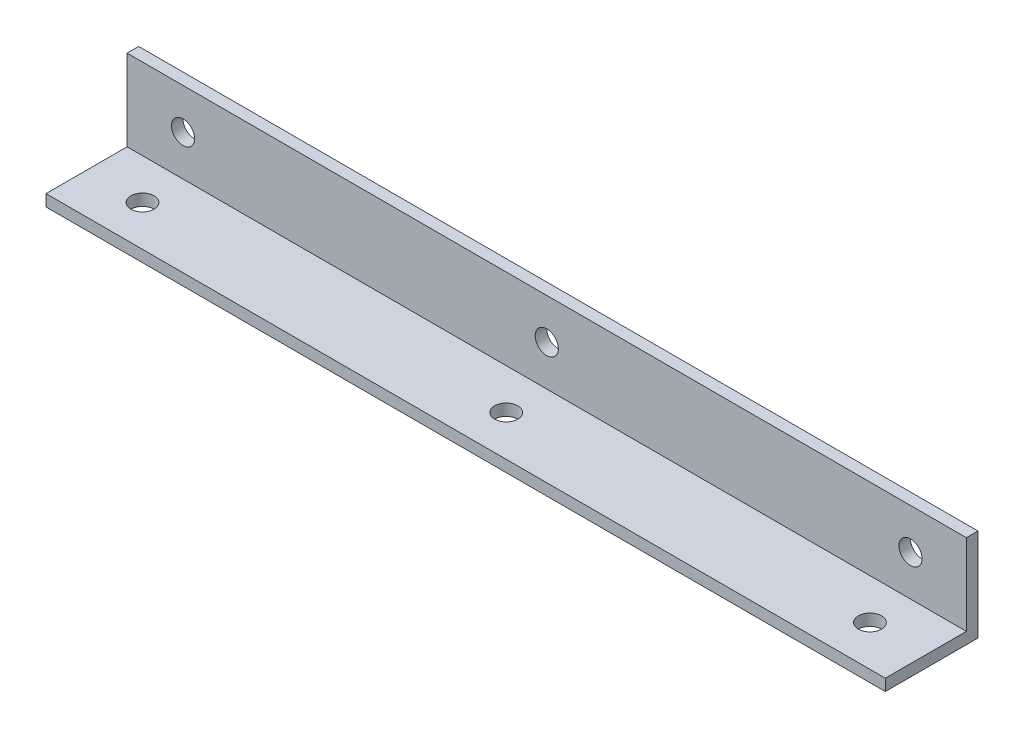
ISO-10303-21;
HEADER;
FILE_DESCRIPTION(('STEP AP214'),'2;1');
FILE_NAME('part.step','',(''),(''),'','','');
FILE_SCHEMA(('AUTOMOTIVE_DESIGN { 1 0 10303 214 1 1 1 1 }'));
ENDSEC;
DATA;
#1=APPLICATION_CONTEXT('core data for automotive mechanical design processes');
#2=APPLICATION_PROTOCOL_DEFINITION('international standard','automotive_design',2000,#1);
#3=PRODUCT_CONTEXT('',#1,'mechanical');
#4=PRODUCT('Part','Part','',(#3));
#5=PRODUCT_RELATED_PRODUCT_CATEGORY('part','',(#4));
#6=PRODUCT_DEFINITION_FORMATION('','',#4);
#7=PRODUCT_DEFINITION_CONTEXT('part definition',#1,'design');
#8=PRODUCT_DEFINITION('design','',#6,#7);
#9=PRODUCT_DEFINITION_SHAPE('','',#8);
#10=(LENGTH_UNIT() NAMED_UNIT(*) SI_UNIT(.MILLI.,.METRE.));
#11=(NAMED_UNIT(*) PLANE_ANGLE_UNIT() SI_UNIT($,.RADIAN.));
#12=(NAMED_UNIT(*) SI_UNIT($,.STERADIAN.) SOLID_ANGLE_UNIT());
#13=UNCERTAINTY_MEASURE_WITH_UNIT(LENGTH_MEASURE(1.E-05),#10,'distance_accuracy_value','');
#14=(GEOMETRIC_REPRESENTATION_CONTEXT(3) GLOBAL_UNCERTAINTY_ASSIGNED_CONTEXT((#13)) GLOBAL_UNIT_ASSIGNED_CONTEXT((#10,
#11,#12)) REPRESENTATION_CONTEXT('',''));
#15=CARTESIAN_POINT('',(0.,0.,0.));
#16=DIRECTION('',(0.,0.,1.));
#17=DIRECTION('',(1.,0.,0.));
#18=AXIS2_PLACEMENT_3D('',#15,#16,#17);
#19=CARTESIAN_POINT('',(115.,14.2875,3.175));
#20=DIRECTION('',(0.,0.,-1.));
#21=DIRECTION('',(-1.,0.,0.));
#22=AXIS2_PLACEMENT_3D('',#19,#20,#21);
#23=CYLINDRICAL_SURFACE('',#22,3.17500000000001);
#24=CARTESIAN_POINT('',(115.,14.2875,0.));
#25=DIRECTION('',(0.,0.,-1.));
#26=DIRECTION('',(-1.,0.,0.));
#27=AXIS2_PLACEMENT_3D('',#24,#25,#26);
#28=CIRCLE('',#27,3.17500000000001);
#29=CARTESIAN_POINT('',(111.825,14.2875,0.));
#30=VERTEX_POINT('',#29);
#31=EDGE_CURVE('E121',#30,#30,#28,.F.);
#32=ORIENTED_EDGE('',*,*,#31,.F.);
#33=EDGE_LOOP('',(#32));
#34=FACE_BOUND('',#33,.T.);
#35=CARTESIAN_POINT('',(115.,14.2875,3.175));
#36=DIRECTION('',(0.,0.,-1.));
#37=DIRECTION('',(-1.,0.,0.));
#38=AXIS2_PLACEMENT_3D('',#35,#36,#37);
#39=CIRCLE('',#38,3.17500000000001);
#40=CARTESIAN_POINT('',(111.825,14.2875,3.175));
#41=VERTEX_POINT('',#40);
#42=EDGE_CURVE('E19',#41,#41,#39,.T.);
#43=ORIENTED_EDGE('',*,*,#42,.F.);
#44=EDGE_LOOP('',(#43));
#45=FACE_BOUND('',#44,.T.);
#46=ADVANCED_FACE('F16',(#34,#45),#23,.F.);
#47=CARTESIAN_POINT('',(15.3333333333333,14.2875,3.175));
#48=DIRECTION('',(0.,0.,-1.));
#49=DIRECTION('',(-1.,0.,0.));
#50=AXIS2_PLACEMENT_3D('',#47,#48,#49);
#51=CYLINDRICAL_SURFACE('',#50,3.175);
#52=CARTESIAN_POINT('',(15.3333333333333,14.2875,0.));
#53=DIRECTION('',(0.,0.,-1.));
#54=DIRECTION('',(-1.,0.,0.));
#55=AXIS2_PLACEMENT_3D('',#52,#53,#54);
#56=CIRCLE('',#55,3.175);
#57=CARTESIAN_POINT('',(12.1583333333333,14.2875,0.));
#58=VERTEX_POINT('',#57);
#59=EDGE_CURVE('E118',#58,#58,#56,.F.);
#60=ORIENTED_EDGE('',*,*,#59,.F.);
#61=EDGE_LOOP('',(#60));
#62=FACE_BOUND('',#61,.T.);
#63=CARTESIAN_POINT('',(15.3333333333333,14.2875,3.175));
#64=DIRECTION('',(0.,0.,-1.));
#65=DIRECTION('',(-1.,0.,0.));
#66=AXIS2_PLACEMENT_3D('',#63,#64,#65);
#67=CIRCLE('',#66,3.175);
#68=CARTESIAN_POINT('',(12.1583333333333,14.2875,3.175));
#69=VERTEX_POINT('',#68);
#70=EDGE_CURVE('E126',#69,#69,#67,.T.);
#71=ORIENTED_EDGE('',*,*,#70,.F.);
#72=EDGE_LOOP('',(#71));
#73=FACE_BOUND('',#72,.T.);
#74=ADVANCED_FACE('F135',(#62,#73),#51,.F.);
#75=CARTESIAN_POINT('',(214.666666666667,14.2875,3.175));
#76=DIRECTION('',(0.,0.,-1.));
#77=DIRECTION('',(-1.,0.,0.));
#78=AXIS2_PLACEMENT_3D('',#75,#76,#77);
#79=CYLINDRICAL_SURFACE('',#78,3.17499999999999);
#80=CARTESIAN_POINT('',(214.666666666667,14.2875,0.));
#81=DIRECTION('',(0.,0.,-1.));
#82=DIRECTION('',(-1.,0.,0.));
#83=AXIS2_PLACEMENT_3D('',#80,#81,#82);
#84=CIRCLE('',#83,3.17499999999999);
#85=CARTESIAN_POINT('',(211.491666666667,14.2875,0.));
#86=VERTEX_POINT('',#85);
#87=EDGE_CURVE('E114',#86,#86,#84,.F.);
#88=ORIENTED_EDGE('',*,*,#87,.F.);
#89=EDGE_LOOP('',(#88));
#90=FACE_BOUND('',#89,.T.);
#91=CARTESIAN_POINT('',(214.666666666667,14.2875,3.175));
#92=DIRECTION('',(0.,0.,-1.));
#93=DIRECTION('',(-1.,0.,0.));
#94=AXIS2_PLACEMENT_3D('',#91,#92,#93);
#95=CIRCLE('',#94,3.17499999999999);
#96=CARTESIAN_POINT('',(211.491666666667,14.2875,3.175));
#97=VERTEX_POINT('',#96);
#98=EDGE_CURVE('E84',#97,#97,#95,.T.);
#99=ORIENTED_EDGE('',*,*,#98,.F.);
#100=EDGE_LOOP('',(#99));
#101=FACE_BOUND('',#100,.T.);
#102=ADVANCED_FACE('F141',(#90,#101),#79,.F.);
#103=CARTESIAN_POINT('',(0.,25.4,0.));
#104=DIRECTION('',(0.,1.,0.));
#105=DIRECTION('',(0.,0.,1.));
#106=AXIS2_PLACEMENT_3D('',#103,#104,#105);
#107=PLANE('',#106);
#108=DIRECTION('',(0.,0.,-1.));
#109=VECTOR('',#108,1.);
#110=CARTESIAN_POINT('',(230.,25.4,12.7));
#111=LINE('',#110,#109);
#112=CARTESIAN_POINT('',(230.,25.4,0.));
#113=VERTEX_POINT('',#112);
#114=CARTESIAN_POINT('',(230.,25.4,3.175));
#115=VERTEX_POINT('',#114);
#116=EDGE_CURVE('E117',#113,#115,#111,.F.);
#117=ORIENTED_EDGE('',*,*,#116,.F.);
#118=DIRECTION('',(-1.,0.,0.));
#119=VECTOR('',#118,1.);
#120=CARTESIAN_POINT('',(0.,25.4,0.));
#121=LINE('',#120,#119);
#122=CARTESIAN_POINT('',(0.,25.4,0.));
#123=VERTEX_POINT('',#122);
#124=EDGE_CURVE('E124',#123,#113,#121,.F.);
#125=ORIENTED_EDGE('',*,*,#124,.F.);
#126=DIRECTION('',(0.,0.,-1.));
#127=VECTOR('',#126,1.);
#128=CARTESIAN_POINT('',(0.,25.4,12.7));
#129=LINE('',#128,#127);
#130=CARTESIAN_POINT('',(0.,25.4,3.175));
#131=VERTEX_POINT('',#130);
#132=EDGE_CURVE('E90',#123,#131,#129,.F.);
#133=ORIENTED_EDGE('',*,*,#132,.T.);
#134=DIRECTION('',(1.,0.,0.));
#135=VECTOR('',#134,1.);
#136=CARTESIAN_POINT('',(0.,25.4,3.175));
#137=LINE('',#136,#135);
#138=EDGE_CURVE('E66',#115,#131,#137,.F.);
#139=ORIENTED_EDGE('',*,*,#138,.F.);
#140=EDGE_LOOP('',(#117,#125,#133,#139));
#141=FACE_BOUND('',#140,.T.);
#142=ADVANCED_FACE('F182',(#141),#107,.T.);
#143=CARTESIAN_POINT('',(0.,25.4,3.175));
#144=DIRECTION('',(0.,0.,1.));
#145=DIRECTION('',(1.,0.,0.));
#146=AXIS2_PLACEMENT_3D('',#143,#144,#145);
#147=PLANE('',#146);
#148=ORIENTED_EDGE('',*,*,#98,.T.);
#149=EDGE_LOOP('',(#148));
#150=FACE_BOUND('',#149,.T.);
#151=ORIENTED_EDGE('',*,*,#70,.T.);
#152=EDGE_LOOP('',(#151));
#153=FACE_BOUND('',#152,.T.);
#154=ORIENTED_EDGE('',*,*,#42,.T.);
#155=EDGE_LOOP('',(#154));
#156=FACE_BOUND('',#155,.T.);
#157=DIRECTION('',(0.,1.,0.));
#158=VECTOR('',#157,1.);
#159=CARTESIAN_POINT('',(230.,12.7,3.175));
#160=LINE('',#159,#158);
#161=CARTESIAN_POINT('',(230.,3.175,3.175));
#162=VERTEX_POINT('',#161);
#163=EDGE_CURVE('E222',#115,#162,#160,.F.);
#164=ORIENTED_EDGE('',*,*,#163,.F.);
#165=ORIENTED_EDGE('',*,*,#138,.T.);
#166=DIRECTION('',(0.,1.,0.));
#167=VECTOR('',#166,1.);
#168=CARTESIAN_POINT('',(0.,12.7,3.175));
#169=LINE('',#168,#167);
#170=CARTESIAN_POINT('',(0.,3.175,3.175));
#171=VERTEX_POINT('',#170);
#172=EDGE_CURVE('E69',#131,#171,#169,.F.);
#173=ORIENTED_EDGE('',*,*,#172,.T.);
#174=DIRECTION('',(1.,0.,0.));
#175=VECTOR('',#174,1.);
#176=CARTESIAN_POINT('',(0.,3.175,3.175));
#177=LINE('',#176,#175);
#178=EDGE_CURVE('E72',#162,#171,#177,.F.);
#179=ORIENTED_EDGE('',*,*,#178,.F.);
#180=EDGE_LOOP('',(#164,#165,#173,#179));
#181=FACE_BOUND('',#180,.T.);
#182=ADVANCED_FACE('F71',(#150,#153,#156,#181),#147,.T.);
#183=CARTESIAN_POINT('',(0.,3.175,3.175));
#184=DIRECTION('',(0.,1.,0.));
#185=DIRECTION('',(0.,0.,1.));
#186=AXIS2_PLACEMENT_3D('',#183,#184,#185);
#187=PLANE('',#186);
#188=CARTESIAN_POINT('',(214.666666666667,3.175,14.2875));
#189=DIRECTION('',(0.,-1.,0.));
#190=DIRECTION('',(0.,0.,-1.));
#191=AXIS2_PLACEMENT_3D('',#188,#189,#190);
#192=CIRCLE('',#191,3.17499999999999);
#193=CARTESIAN_POINT('',(214.666666666667,3.175,11.1125));
#194=VERTEX_POINT('',#193);
#195=EDGE_CURVE('E103',#194,#194,#192,.T.);
#196=ORIENTED_EDGE('',*,*,#195,.T.);
#197=EDGE_LOOP('',(#196));
#198=FACE_BOUND('',#197,.T.);
#199=CARTESIAN_POINT('',(115.,3.175,14.2875));
#200=DIRECTION('',(0.,-1.,0.));
#201=DIRECTION('',(0.,0.,-1.));
#202=AXIS2_PLACEMENT_3D('',#199,#200,#201);
#203=CIRCLE('',#202,3.17500000000001);
#204=CARTESIAN_POINT('',(115.,3.175,11.1125));
#205=VERTEX_POINT('',#204);
#206=EDGE_CURVE('E107',#205,#205,#203,.T.);
#207=ORIENTED_EDGE('',*,*,#206,.T.);
#208=EDGE_LOOP('',(#207));
#209=FACE_BOUND('',#208,.T.);
#210=CARTESIAN_POINT('',(15.3333333333333,3.175,14.2875));
#211=DIRECTION('',(0.,-1.,0.));
#212=DIRECTION('',(0.,0.,-1.));
#213=AXIS2_PLACEMENT_3D('',#210,#211,#212);
#214=CIRCLE('',#213,3.175);
#215=CARTESIAN_POINT('',(15.3333333333333,3.175,11.1125));
#216=VERTEX_POINT('',#215);
#217=EDGE_CURVE('E110',#216,#216,#214,.T.);
#218=ORIENTED_EDGE('',*,*,#217,.T.);
#219=EDGE_LOOP('',(#218));
#220=FACE_BOUND('',#219,.T.);
#221=DIRECTION('',(0.,0.,-1.));
#222=VECTOR('',#221,1.);
#223=CARTESIAN_POINT('',(230.,3.175,12.7));
#224=LINE('',#223,#222);
#225=CARTESIAN_POINT('',(230.,3.175,25.4));
#226=VERTEX_POINT('',#225);
#227=EDGE_CURVE('E82',#162,#226,#224,.F.);
#228=ORIENTED_EDGE('',*,*,#227,.F.);
#229=ORIENTED_EDGE('',*,*,#178,.T.);
#230=DIRECTION('',(0.,0.,-1.));
#231=VECTOR('',#230,1.);
#232=CARTESIAN_POINT('',(0.,3.175,12.7));
#233=LINE('',#232,#231);
#234=CARTESIAN_POINT('',(0.,3.175,25.4));
#235=VERTEX_POINT('',#234);
#236=EDGE_CURVE('E76',#171,#235,#233,.F.);
#237=ORIENTED_EDGE('',*,*,#236,.T.);
#238=DIRECTION('',(1.,0.,0.));
#239=VECTOR('',#238,1.);
#240=CARTESIAN_POINT('',(0.,3.175,25.4));
#241=LINE('',#240,#239);
#242=EDGE_CURVE('E113',#226,#235,#241,.F.);
#243=ORIENTED_EDGE('',*,*,#242,.F.);
#244=EDGE_LOOP('',(#228,#229,#237,#243));
#245=FACE_BOUND('',#244,.T.);
#246=ADVANCED_FACE('F79',(#198,#209,#220,#245),#187,.T.);
#247=CARTESIAN_POINT('',(0.,12.7,12.7));
#248=DIRECTION('',(1.,0.,0.));
#249=DIRECTION('',(0.,0.,-1.));
#250=AXIS2_PLACEMENT_3D('',#247,#248,#249);
#251=PLANE('',#250);
#252=DIRECTION('',(0.,1.,0.));
#253=VECTOR('',#252,1.);
#254=CARTESIAN_POINT('',(0.,0.,0.));
#255=LINE('',#254,#253);
#256=CARTESIAN_POINT('',(0.,0.,0.));
#257=VERTEX_POINT('',#256);
#258=EDGE_CURVE('E92',#257,#123,#255,.T.);
#259=ORIENTED_EDGE('',*,*,#258,.F.);
#260=DIRECTION('',(0.,0.,-1.));
#261=VECTOR('',#260,1.);
#262=CARTESIAN_POINT('',(0.,0.,25.4));
#263=LINE('',#262,#261);
#264=CARTESIAN_POINT('',(0.,0.,25.4));
#265=VERTEX_POINT('',#264);
#266=EDGE_CURVE('E106',#265,#257,#263,.T.);
#267=ORIENTED_EDGE('',*,*,#266,.F.);
#268=DIRECTION('',(0.,1.,0.));
#269=VECTOR('',#268,1.);
#270=CARTESIAN_POINT('',(0.,3.175,25.4));
#271=LINE('',#270,#269);
#272=EDGE_CURVE('E88',#235,#265,#271,.F.);
#273=ORIENTED_EDGE('',*,*,#272,.F.);
#274=ORIENTED_EDGE('',*,*,#236,.F.);
#275=ORIENTED_EDGE('',*,*,#172,.F.);
#276=ORIENTED_EDGE('',*,*,#132,.F.);
#277=EDGE_LOOP('',(#259,#267,#273,#274,#275,#276));
#278=FACE_BOUND('',#277,.T.);
#279=ADVANCED_FACE('F86',(#278),#251,.F.);
#280=CARTESIAN_POINT('',(0.,0.,0.));
#281=DIRECTION('',(0.,0.,-1.));
#282=DIRECTION('',(-1.,0.,0.));
#283=AXIS2_PLACEMENT_3D('',#280,#281,#282);
#284=PLANE('',#283);
#285=ORIENTED_EDGE('',*,*,#87,.T.);
#286=EDGE_LOOP('',(#285));
#287=FACE_BOUND('',#286,.T.);
#288=ORIENTED_EDGE('',*,*,#59,.T.);
#289=EDGE_LOOP('',(#288));
#290=FACE_BOUND('',#289,.T.);
#291=ORIENTED_EDGE('',*,*,#31,.T.);
#292=EDGE_LOOP('',(#291));
#293=FACE_BOUND('',#292,.T.);
#294=DIRECTION('',(0.,1.,0.));
#295=VECTOR('',#294,1.);
#296=CARTESIAN_POINT('',(230.,12.7,0.));
#297=LINE('',#296,#295);
#298=CARTESIAN_POINT('',(230.,0.,0.));
#299=VERTEX_POINT('',#298);
#300=EDGE_CURVE('E201',#299,#113,#297,.T.);
#301=ORIENTED_EDGE('',*,*,#300,.F.);
#302=DIRECTION('',(1.,0.,0.));
#303=VECTOR('',#302,1.);
#304=CARTESIAN_POINT('',(0.,0.,0.));
#305=LINE('',#304,#303);
#306=EDGE_CURVE('E204',#257,#299,#305,.T.);
#307=ORIENTED_EDGE('',*,*,#306,.F.);
#308=ORIENTED_EDGE('',*,*,#258,.T.);
#309=ORIENTED_EDGE('',*,*,#124,.T.);
#310=EDGE_LOOP('',(#301,#307,#308,#309));
#311=FACE_BOUND('',#310,.T.);
#312=ADVANCED_FACE('F171',(#287,#290,#293,#311),#284,.T.);
#313=CARTESIAN_POINT('',(230.,12.7,12.7));
#314=DIRECTION('',(1.,0.,0.));
#315=DIRECTION('',(0.,0.,-1.));
#316=AXIS2_PLACEMENT_3D('',#313,#314,#315);
#317=PLANE('',#316);
#318=DIRECTION('',(0.,0.,-1.));
#319=VECTOR('',#318,1.);
#320=CARTESIAN_POINT('',(230.,0.,25.4));
#321=LINE('',#320,#319);
#322=CARTESIAN_POINT('',(230.,0.,25.4));
#323=VERTEX_POINT('',#322);
#324=EDGE_CURVE('E210',#299,#323,#321,.F.);
#325=ORIENTED_EDGE('',*,*,#324,.F.);
#326=ORIENTED_EDGE('',*,*,#300,.T.);
#327=ORIENTED_EDGE('',*,*,#116,.T.);
#328=ORIENTED_EDGE('',*,*,#163,.T.);
#329=ORIENTED_EDGE('',*,*,#227,.T.);
#330=DIRECTION('',(0.,1.,0.));
#331=VECTOR('',#330,1.);
#332=CARTESIAN_POINT('',(230.,3.175,25.4));
#333=LINE('',#332,#331);
#334=EDGE_CURVE('E34',#323,#226,#333,.T.);
#335=ORIENTED_EDGE('',*,*,#334,.F.);
#336=EDGE_LOOP('',(#325,#326,#327,#328,#329,#335));
#337=FACE_BOUND('',#336,.T.);
#338=ADVANCED_FACE('F167',(#337),#317,.T.);
#339=CARTESIAN_POINT('',(0.,3.175,25.4));
#340=DIRECTION('',(0.,0.,1.));
#341=DIRECTION('',(1.,0.,0.));
#342=AXIS2_PLACEMENT_3D('',#339,#340,#341);
#343=PLANE('',#342);
#344=ORIENTED_EDGE('',*,*,#334,.T.);
#345=ORIENTED_EDGE('',*,*,#242,.T.);
#346=ORIENTED_EDGE('',*,*,#272,.T.);
#347=DIRECTION('',(1.,0.,0.));
#348=VECTOR('',#347,1.);
#349=CARTESIAN_POINT('',(0.,0.,25.4));
#350=LINE('',#349,#348);
#351=EDGE_CURVE('E102',#323,#265,#350,.F.);
#352=ORIENTED_EDGE('',*,*,#351,.F.);
#353=EDGE_LOOP('',(#344,#345,#346,#352));
#354=FACE_BOUND('',#353,.T.);
#355=ADVANCED_FACE('F163',(#354),#343,.T.);
#356=CARTESIAN_POINT('',(15.3333333333333,3.175,14.2875));
#357=DIRECTION('',(0.,-1.,0.));
#358=DIRECTION('',(0.,0.,-1.));
#359=AXIS2_PLACEMENT_3D('',#356,#357,#358);
#360=CYLINDRICAL_SURFACE('',#359,3.175);
#361=CARTESIAN_POINT('',(15.3333333333333,0.,14.2875));
#362=DIRECTION('',(0.,-1.,0.));
#363=DIRECTION('',(0.,0.,-1.));
#364=AXIS2_PLACEMENT_3D('',#361,#362,#363);
#365=CIRCLE('',#364,3.175);
#366=CARTESIAN_POINT('',(15.3333333333333,0.,11.1125));
#367=VERTEX_POINT('',#366);
#368=EDGE_CURVE('E99',#367,#367,#365,.F.);
#369=ORIENTED_EDGE('',*,*,#368,.F.);
#370=EDGE_LOOP('',(#369));
#371=FACE_BOUND('',#370,.T.);
#372=ORIENTED_EDGE('',*,*,#217,.F.);
#373=EDGE_LOOP('',(#372));
#374=FACE_BOUND('',#373,.T.);
#375=ADVANCED_FACE('F159',(#371,#374),#360,.F.);
#376=CARTESIAN_POINT('',(115.,3.175,14.2875));
#377=DIRECTION('',(0.,-1.,0.));
#378=DIRECTION('',(0.,0.,-1.));
#379=AXIS2_PLACEMENT_3D('',#376,#377,#378);
#380=CYLINDRICAL_SURFACE('',#379,3.17500000000001);
#381=CARTESIAN_POINT('',(115.,0.,14.2875));
#382=DIRECTION('',(0.,-1.,0.));
#383=DIRECTION('',(0.,0.,-1.));
#384=AXIS2_PLACEMENT_3D('',#381,#382,#383);
#385=CIRCLE('',#384,3.17500000000001);
#386=CARTESIAN_POINT('',(115.,0.,11.1125));
#387=VERTEX_POINT('',#386);
#388=EDGE_CURVE('E25',#387,#387,#385,.F.);
#389=ORIENTED_EDGE('',*,*,#388,.F.);
#390=EDGE_LOOP('',(#389));
#391=FACE_BOUND('',#390,.T.);
#392=ORIENTED_EDGE('',*,*,#206,.F.);
#393=EDGE_LOOP('',(#392));
#394=FACE_BOUND('',#393,.T.);
#395=ADVANCED_FACE('F152',(#391,#394),#380,.F.);
#396=CARTESIAN_POINT('',(214.666666666667,3.175,14.2875));
#397=DIRECTION('',(0.,-1.,0.));
#398=DIRECTION('',(0.,0.,-1.));
#399=AXIS2_PLACEMENT_3D('',#396,#397,#398);
#400=CYLINDRICAL_SURFACE('',#399,3.17499999999999);
#401=CARTESIAN_POINT('',(214.666666666667,0.,14.2875));
#402=DIRECTION('',(0.,-1.,0.));
#403=DIRECTION('',(0.,0.,-1.));
#404=AXIS2_PLACEMENT_3D('',#401,#402,#403);
#405=CIRCLE('',#404,3.17499999999999);
#406=CARTESIAN_POINT('',(214.666666666667,0.,11.1125));
#407=VERTEX_POINT('',#406);
#408=EDGE_CURVE('E11',#407,#407,#405,.F.);
#409=ORIENTED_EDGE('',*,*,#408,.F.);
#410=EDGE_LOOP('',(#409));
#411=FACE_BOUND('',#410,.T.);
#412=ORIENTED_EDGE('',*,*,#195,.F.);
#413=EDGE_LOOP('',(#412));
#414=FACE_BOUND('',#413,.T.);
#415=ADVANCED_FACE('F146',(#411,#414),#400,.F.);
#416=CARTESIAN_POINT('',(0.,0.,25.4));
#417=DIRECTION('',(0.,-1.,0.));
#418=DIRECTION('',(0.,0.,-1.));
#419=AXIS2_PLACEMENT_3D('',#416,#417,#418);
#420=PLANE('',#419);
#421=ORIENTED_EDGE('',*,*,#408,.T.);
#422=EDGE_LOOP('',(#421));
#423=FACE_BOUND('',#422,.T.);
#424=ORIENTED_EDGE('',*,*,#388,.T.);
#425=EDGE_LOOP('',(#424));
#426=FACE_BOUND('',#425,.T.);
#427=ORIENTED_EDGE('',*,*,#368,.T.);
#428=EDGE_LOOP('',(#427));
#429=FACE_BOUND('',#428,.T.);
#430=ORIENTED_EDGE('',*,*,#324,.T.);
#431=ORIENTED_EDGE('',*,*,#351,.T.);
#432=ORIENTED_EDGE('',*,*,#266,.T.);
#433=ORIENTED_EDGE('',*,*,#306,.T.);
#434=EDGE_LOOP('',(#430,#431,#432,#433));
#435=FACE_BOUND('',#434,.T.);
#436=ADVANCED_FACE('F144',(#423,#426,#429,#435),#420,.T.);
#437=CLOSED_SHELL('',(#46,#74,#102,#142,#182,#246,#279,#312,#338,#355,#375,#395,#415,#436));
#438=MANIFOLD_SOLID_BREP('B1',#437);
#439=ADVANCED_BREP_SHAPE_REPRESENTATION('',(#18,#438),#14);
#440=SHAPE_DEFINITION_REPRESENTATION(#9,#439);
ENDSEC;
END-ISO-10303-21;
